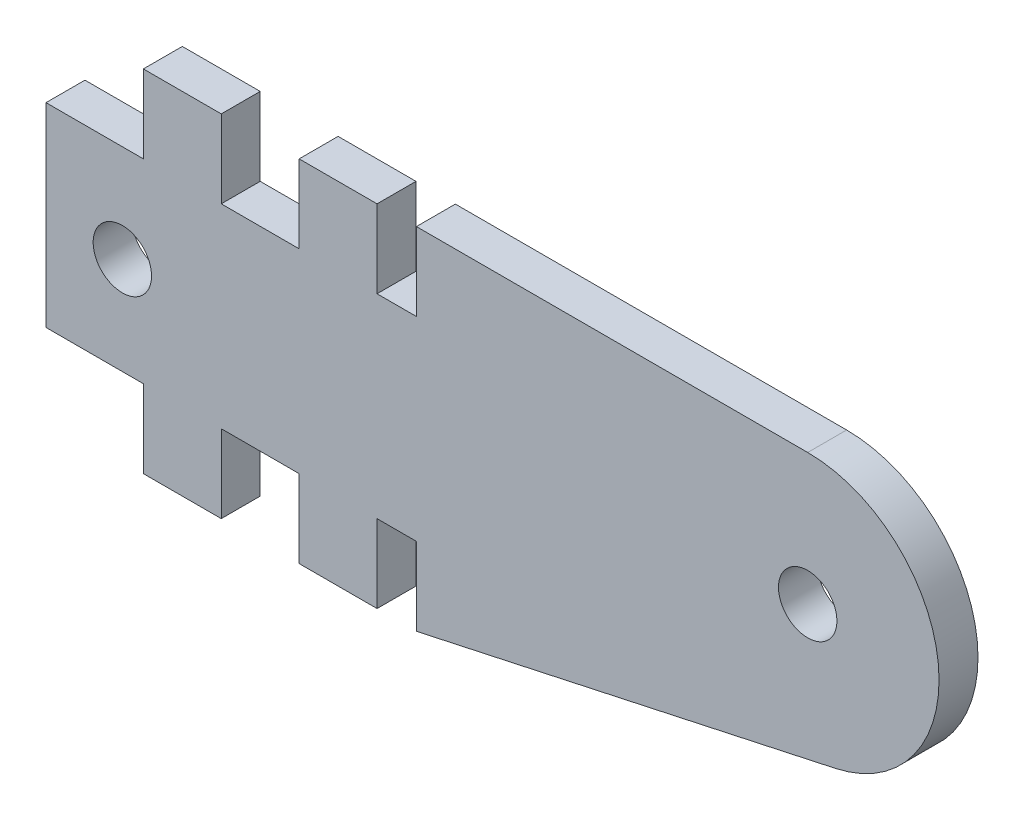
ISO-10303-21;
HEADER;
FILE_DESCRIPTION(('STEP AP214'),'2;1');
FILE_NAME('part.step','',(''),(''),'','','');
FILE_SCHEMA(('AUTOMOTIVE_DESIGN { 1 0 10303 214 1 1 1 1 }'));
ENDSEC;
DATA;
#1=APPLICATION_CONTEXT('core data for automotive mechanical design processes');
#2=APPLICATION_PROTOCOL_DEFINITION('international standard','automotive_design',2000,#1);
#3=PRODUCT_CONTEXT('',#1,'mechanical');
#4=PRODUCT('Part','Part','',(#3));
#5=PRODUCT_RELATED_PRODUCT_CATEGORY('part','',(#4));
#6=PRODUCT_DEFINITION_FORMATION('','',#4);
#7=PRODUCT_DEFINITION_CONTEXT('part definition',#1,'design');
#8=PRODUCT_DEFINITION('design','',#6,#7);
#9=PRODUCT_DEFINITION_SHAPE('','',#8);
#10=(LENGTH_UNIT() NAMED_UNIT(*) SI_UNIT(.MILLI.,.METRE.));
#11=(NAMED_UNIT(*) PLANE_ANGLE_UNIT() SI_UNIT($,.RADIAN.));
#12=(NAMED_UNIT(*) SI_UNIT($,.STERADIAN.) SOLID_ANGLE_UNIT());
#13=UNCERTAINTY_MEASURE_WITH_UNIT(LENGTH_MEASURE(1.E-05),#10,'distance_accuracy_value','');
#14=(GEOMETRIC_REPRESENTATION_CONTEXT(3) GLOBAL_UNCERTAINTY_ASSIGNED_CONTEXT((#13)) GLOBAL_UNIT_ASSIGNED_CONTEXT((#10,
#11,#12)) REPRESENTATION_CONTEXT('',''));
#15=CARTESIAN_POINT('',(0.,0.,0.));
#16=DIRECTION('',(0.,0.,1.));
#17=DIRECTION('',(1.,0.,0.));
#18=AXIS2_PLACEMENT_3D('',#15,#16,#17);
#19=CARTESIAN_POINT('',(39.11449585108,11.2546452739517,2.));
#20=DIRECTION('',(0.,0.,-1.));
#21=DIRECTION('',(-1.,0.,0.));
#22=AXIS2_PLACEMENT_3D('',#19,#20,#21);
#23=PLANE('',#22);
#24=CARTESIAN_POINT('',(39.11449585108,11.2546452739517,2.));
#25=DIRECTION('',(0.,0.,1.));
#26=DIRECTION('',(-1.,0.,0.));
#27=AXIS2_PLACEMENT_3D('',#24,#25,#26);
#28=CIRCLE('',#27,1.5);
#29=CARTESIAN_POINT('',(37.61449585108,11.2546452739517,2.));
#30=VERTEX_POINT('',#29);
#31=EDGE_CURVE('E230',#30,#30,#28,.T.);
#32=ORIENTED_EDGE('',*,*,#31,.F.);
#33=EDGE_LOOP('',(#32));
#34=FACE_BOUND('',#33,.T.);
#35=CARTESIAN_POINT('',(39.11449585108,11.2546452739517,2.));
#36=DIRECTION('',(0.,0.,1.));
#37=DIRECTION('',(-1.,0.,0.));
#38=AXIS2_PLACEMENT_3D('',#35,#36,#37);
#39=CIRCLE('',#38,6.74534308282998);
#40=CARTESIAN_POINT('',(40.5426460894979,4.66222233533582,2.));
#41=VERTEX_POINT('',#40);
#42=CARTESIAN_POINT('',(39.11449585108,17.9999883567817,2.));
#43=VERTEX_POINT('',#42);
#44=EDGE_CURVE('E273',#41,#43,#39,.T.);
#45=ORIENTED_EDGE('',*,*,#44,.T.);
#46=DIRECTION('',(-1.,0.,0.));
#47=VECTOR('',#46,1.);
#48=CARTESIAN_POINT('',(19.0215619335038,17.9999883567817,2.));
#49=LINE('',#48,#47);
#50=CARTESIAN_POINT('',(19.0215619335038,17.9999883567817,2.));
#51=VERTEX_POINT('',#50);
#52=EDGE_CURVE('E141',#43,#51,#49,.T.);
#53=ORIENTED_EDGE('',*,*,#52,.T.);
#54=DIRECTION('',(0.,-1.,0.));
#55=VECTOR('',#54,1.);
#56=CARTESIAN_POINT('',(19.0215619335038,13.9999883567817,2.));
#57=LINE('',#56,#55);
#58=CARTESIAN_POINT('',(19.0215619335038,13.9999883567817,2.));
#59=VERTEX_POINT('',#58);
#60=EDGE_CURVE('E336',#51,#59,#57,.T.);
#61=ORIENTED_EDGE('',*,*,#60,.T.);
#62=DIRECTION('',(-1.,0.,0.));
#63=VECTOR('',#62,1.);
#64=CARTESIAN_POINT('',(17.,13.9999883567817,2.));
#65=LINE('',#64,#63);
#66=CARTESIAN_POINT('',(17.,13.9999883567817,2.));
#67=VERTEX_POINT('',#66);
#68=EDGE_CURVE('E355',#59,#67,#65,.T.);
#69=ORIENTED_EDGE('',*,*,#68,.T.);
#70=DIRECTION('',(0.,1.,0.));
#71=VECTOR('',#70,1.);
#72=CARTESIAN_POINT('',(17.,17.9999883567817,2.));
#73=LINE('',#72,#71);
#74=CARTESIAN_POINT('',(17.,17.9999883567817,2.));
#75=VERTEX_POINT('',#74);
#76=EDGE_CURVE('E352',#67,#75,#73,.T.);
#77=ORIENTED_EDGE('',*,*,#76,.T.);
#78=DIRECTION('',(-1.,0.,0.));
#79=VECTOR('',#78,1.);
#80=CARTESIAN_POINT('',(13.,17.9999883567817,2.));
#81=LINE('',#80,#79);
#82=CARTESIAN_POINT('',(13.,17.9999883567817,2.));
#83=VERTEX_POINT('',#82);
#84=EDGE_CURVE('E354',#75,#83,#81,.T.);
#85=ORIENTED_EDGE('',*,*,#84,.T.);
#86=DIRECTION('',(0.,-1.,0.));
#87=VECTOR('',#86,1.);
#88=CARTESIAN_POINT('',(13.,13.9999883567817,2.));
#89=LINE('',#88,#87);
#90=CARTESIAN_POINT('',(13.,13.9999883567817,2.));
#91=VERTEX_POINT('',#90);
#92=EDGE_CURVE('E357',#83,#91,#89,.T.);
#93=ORIENTED_EDGE('',*,*,#92,.T.);
#94=DIRECTION('',(-1.,0.,0.));
#95=VECTOR('',#94,1.);
#96=CARTESIAN_POINT('',(9.,13.9999883567817,2.));
#97=LINE('',#96,#95);
#98=CARTESIAN_POINT('',(9.,13.9999883567817,2.));
#99=VERTEX_POINT('',#98);
#100=EDGE_CURVE('E363',#91,#99,#97,.T.);
#101=ORIENTED_EDGE('',*,*,#100,.T.);
#102=DIRECTION('',(0.,1.,0.));
#103=VECTOR('',#102,1.);
#104=CARTESIAN_POINT('',(9.,17.9999883567817,2.));
#105=LINE('',#104,#103);
#106=CARTESIAN_POINT('',(9.,17.9999883567817,2.));
#107=VERTEX_POINT('',#106);
#108=EDGE_CURVE('E365',#99,#107,#105,.T.);
#109=ORIENTED_EDGE('',*,*,#108,.T.);
#110=DIRECTION('',(-1.,0.,0.));
#111=VECTOR('',#110,1.);
#112=CARTESIAN_POINT('',(5.,17.9999883567817,2.));
#113=LINE('',#112,#111);
#114=CARTESIAN_POINT('',(5.,17.9999883567817,2.));
#115=VERTEX_POINT('',#114);
#116=EDGE_CURVE('E367',#107,#115,#113,.T.);
#117=ORIENTED_EDGE('',*,*,#116,.T.);
#118=DIRECTION('',(0.,-1.,0.));
#119=VECTOR('',#118,1.);
#120=CARTESIAN_POINT('',(5.,13.9999883567817,2.));
#121=LINE('',#120,#119);
#122=CARTESIAN_POINT('',(5.,13.9999883567817,2.));
#123=VERTEX_POINT('',#122);
#124=EDGE_CURVE('E369',#115,#123,#121,.T.);
#125=ORIENTED_EDGE('',*,*,#124,.T.);
#126=DIRECTION('',(-1.,0.,0.));
#127=VECTOR('',#126,1.);
#128=CARTESIAN_POINT('',(0.,13.9999883567817,2.));
#129=LINE('',#128,#127);
#130=CARTESIAN_POINT('',(0.,13.9999883567817,2.));
#131=VERTEX_POINT('',#130);
#132=EDGE_CURVE('E371',#123,#131,#129,.T.);
#133=ORIENTED_EDGE('',*,*,#132,.T.);
#134=DIRECTION('',(0.,-1.,0.));
#135=VECTOR('',#134,1.);
#136=CARTESIAN_POINT('',(0.,3.99999999999999,2.));
#137=LINE('',#136,#135);
#138=CARTESIAN_POINT('',(0.,3.99999999999999,2.));
#139=VERTEX_POINT('',#138);
#140=EDGE_CURVE('E373',#131,#139,#137,.T.);
#141=ORIENTED_EDGE('',*,*,#140,.T.);
#142=DIRECTION('',(1.,0.,0.));
#143=VECTOR('',#142,1.);
#144=CARTESIAN_POINT('',(5.,3.99999999999999,2.));
#145=LINE('',#144,#143);
#146=CARTESIAN_POINT('',(5.,3.99999999999999,2.));
#147=VERTEX_POINT('',#146);
#148=EDGE_CURVE('E375',#139,#147,#145,.T.);
#149=ORIENTED_EDGE('',*,*,#148,.T.);
#150=DIRECTION('',(0.,-1.,0.));
#151=VECTOR('',#150,1.);
#152=CARTESIAN_POINT('',(5.,3.99999999999999,2.));
#153=LINE('',#152,#151);
#154=CARTESIAN_POINT('',(5.,0.,2.));
#155=VERTEX_POINT('',#154);
#156=EDGE_CURVE('E377',#147,#155,#153,.T.);
#157=ORIENTED_EDGE('',*,*,#156,.T.);
#158=DIRECTION('',(1.,0.,0.));
#159=VECTOR('',#158,1.);
#160=CARTESIAN_POINT('',(5.,0.,2.));
#161=LINE('',#160,#159);
#162=CARTESIAN_POINT('',(8.99999999999999,0.,2.));
#163=VERTEX_POINT('',#162);
#164=EDGE_CURVE('E379',#155,#163,#161,.T.);
#165=ORIENTED_EDGE('',*,*,#164,.T.);
#166=DIRECTION('',(0.,1.,0.));
#167=VECTOR('',#166,1.);
#168=CARTESIAN_POINT('',(8.99999999999999,0.,2.));
#169=LINE('',#168,#167);
#170=CARTESIAN_POINT('',(8.99999999999999,4.,2.));
#171=VERTEX_POINT('',#170);
#172=EDGE_CURVE('E381',#163,#171,#169,.T.);
#173=ORIENTED_EDGE('',*,*,#172,.T.);
#174=DIRECTION('',(1.,0.,0.));
#175=VECTOR('',#174,1.);
#176=CARTESIAN_POINT('',(8.99999999999999,4.,2.));
#177=LINE('',#176,#175);
#178=CARTESIAN_POINT('',(13.,4.,2.));
#179=VERTEX_POINT('',#178);
#180=EDGE_CURVE('E383',#171,#179,#177,.T.);
#181=ORIENTED_EDGE('',*,*,#180,.T.);
#182=DIRECTION('',(0.,-1.,0.));
#183=VECTOR('',#182,1.);
#184=CARTESIAN_POINT('',(13.,4.,2.));
#185=LINE('',#184,#183);
#186=CARTESIAN_POINT('',(13.,0.,2.));
#187=VERTEX_POINT('',#186);
#188=EDGE_CURVE('E385',#179,#187,#185,.T.);
#189=ORIENTED_EDGE('',*,*,#188,.T.);
#190=DIRECTION('',(1.,0.,0.));
#191=VECTOR('',#190,1.);
#192=CARTESIAN_POINT('',(13.,0.,2.));
#193=LINE('',#192,#191);
#194=CARTESIAN_POINT('',(17.,0.,2.));
#195=VERTEX_POINT('',#194);
#196=EDGE_CURVE('E387',#187,#195,#193,.T.);
#197=ORIENTED_EDGE('',*,*,#196,.T.);
#198=DIRECTION('',(0.,1.,0.));
#199=VECTOR('',#198,1.);
#200=CARTESIAN_POINT('',(17.,0.,2.));
#201=LINE('',#200,#199);
#202=CARTESIAN_POINT('',(17.,3.99999999999999,2.));
#203=VERTEX_POINT('',#202);
#204=EDGE_CURVE('E208',#195,#203,#201,.T.);
#205=ORIENTED_EDGE('',*,*,#204,.T.);
#206=DIRECTION('',(1.,0.,0.));
#207=VECTOR('',#206,1.);
#208=CARTESIAN_POINT('',(17.,3.99999999999999,2.));
#209=LINE('',#208,#207);
#210=CARTESIAN_POINT('',(19.0215619335038,3.99999999999999,2.));
#211=VERTEX_POINT('',#210);
#212=EDGE_CURVE('E202',#203,#211,#209,.T.);
#213=ORIENTED_EDGE('',*,*,#212,.T.);
#214=DIRECTION('',(0.,-1.,0.));
#215=VECTOR('',#214,1.);
#216=CARTESIAN_POINT('',(19.0215619335038,3.99999999999999,2.));
#217=LINE('',#216,#215);
#218=CARTESIAN_POINT('',(19.0215619335039,0.,2.));
#219=VERTEX_POINT('',#218);
#220=EDGE_CURVE('E206',#211,#219,#217,.T.);
#221=ORIENTED_EDGE('',*,*,#220,.T.);
#222=DIRECTION('',(0.977329523148595,0.21172388429778,0.));
#223=VECTOR('',#222,1.);
#224=CARTESIAN_POINT('',(19.0215619335039,0.,2.));
#225=LINE('',#224,#223);
#226=EDGE_CURVE('E50',#219,#41,#225,.T.);
#227=ORIENTED_EDGE('',*,*,#226,.T.);
#228=EDGE_LOOP('',(#45,#53,#61,#69,#77,#85,#93,#101,#109,#117,#125,#133,#141,#149,#157,#165,
#173,#181,#189,#197,#205,#213,#221,#227));
#229=FACE_BOUND('',#228,.T.);
#230=CARTESIAN_POINT('',(3.92049009293527,8.99998835678172,2.));
#231=DIRECTION('',(0.,0.,1.));
#232=DIRECTION('',(-1.,0.,0.));
#233=AXIS2_PLACEMENT_3D('',#230,#231,#232);
#234=CIRCLE('',#233,1.5);
#235=CARTESIAN_POINT('',(2.42049009293526,8.99998835678172,2.));
#236=VERTEX_POINT('',#235);
#237=EDGE_CURVE('E430',#236,#236,#234,.T.);
#238=ORIENTED_EDGE('',*,*,#237,.F.);
#239=EDGE_LOOP('',(#238));
#240=FACE_BOUND('',#239,.T.);
#241=ADVANCED_FACE('F33',(#34,#229,#240),#23,.F.);
#242=CARTESIAN_POINT('',(39.11449585108,11.2546452739517,0.));
#243=DIRECTION('',(0.,0.,-1.));
#244=DIRECTION('',(-1.,0.,0.));
#245=AXIS2_PLACEMENT_3D('',#242,#243,#244);
#246=PLANE('',#245);
#247=CARTESIAN_POINT('',(39.11449585108,11.2546452739517,0.));
#248=DIRECTION('',(0.,0.,1.));
#249=DIRECTION('',(-1.,0.,0.));
#250=AXIS2_PLACEMENT_3D('',#247,#248,#249);
#251=CIRCLE('',#250,1.5);
#252=CARTESIAN_POINT('',(37.61449585108,11.2546452739517,0.));
#253=VERTEX_POINT('',#252);
#254=EDGE_CURVE('E435',#253,#253,#251,.T.);
#255=ORIENTED_EDGE('',*,*,#254,.T.);
#256=EDGE_LOOP('',(#255));
#257=FACE_BOUND('',#256,.T.);
#258=CARTESIAN_POINT('',(39.11449585108,11.2546452739517,0.));
#259=DIRECTION('',(0.,0.,1.));
#260=DIRECTION('',(-1.,0.,0.));
#261=AXIS2_PLACEMENT_3D('',#258,#259,#260);
#262=CIRCLE('',#261,6.74534308282998);
#263=CARTESIAN_POINT('',(40.5426460894979,4.66222233533582,0.));
#264=VERTEX_POINT('',#263);
#265=CARTESIAN_POINT('',(39.11449585108,17.9999883567817,0.));
#266=VERTEX_POINT('',#265);
#267=EDGE_CURVE('E226',#264,#266,#262,.T.);
#268=ORIENTED_EDGE('',*,*,#267,.F.);
#269=DIRECTION('',(0.977329523148595,0.21172388429778,0.));
#270=VECTOR('',#269,1.);
#271=CARTESIAN_POINT('',(19.0215619335039,0.,0.));
#272=LINE('',#271,#270);
#273=CARTESIAN_POINT('',(19.0215619335039,0.,0.));
#274=VERTEX_POINT('',#273);
#275=EDGE_CURVE('E133',#274,#264,#272,.T.);
#276=ORIENTED_EDGE('',*,*,#275,.F.);
#277=DIRECTION('',(0.,-1.,0.));
#278=VECTOR('',#277,1.);
#279=CARTESIAN_POINT('',(19.0215619335038,3.99999999999999,0.));
#280=LINE('',#279,#278);
#281=CARTESIAN_POINT('',(19.0215619335038,3.99999999999999,0.));
#282=VERTEX_POINT('',#281);
#283=EDGE_CURVE('E127',#282,#274,#280,.T.);
#284=ORIENTED_EDGE('',*,*,#283,.F.);
#285=DIRECTION('',(1.,0.,0.));
#286=VECTOR('',#285,1.);
#287=CARTESIAN_POINT('',(17.,3.99999999999999,0.));
#288=LINE('',#287,#286);
#289=CARTESIAN_POINT('',(17.,3.99999999999999,0.));
#290=VERTEX_POINT('',#289);
#291=EDGE_CURVE('E216',#290,#282,#288,.T.);
#292=ORIENTED_EDGE('',*,*,#291,.F.);
#293=DIRECTION('',(0.,1.,0.));
#294=VECTOR('',#293,1.);
#295=CARTESIAN_POINT('',(17.,0.,0.));
#296=LINE('',#295,#294);
#297=CARTESIAN_POINT('',(17.,0.,0.));
#298=VERTEX_POINT('',#297);
#299=EDGE_CURVE('E268',#298,#290,#296,.T.);
#300=ORIENTED_EDGE('',*,*,#299,.F.);
#301=DIRECTION('',(1.,0.,0.));
#302=VECTOR('',#301,1.);
#303=CARTESIAN_POINT('',(13.,0.,0.));
#304=LINE('',#303,#302);
#305=CARTESIAN_POINT('',(13.,0.,0.));
#306=VERTEX_POINT('',#305);
#307=EDGE_CURVE('E266',#306,#298,#304,.T.);
#308=ORIENTED_EDGE('',*,*,#307,.F.);
#309=DIRECTION('',(0.,-1.,0.));
#310=VECTOR('',#309,1.);
#311=CARTESIAN_POINT('',(13.,4.,0.));
#312=LINE('',#311,#310);
#313=CARTESIAN_POINT('',(13.,4.,0.));
#314=VERTEX_POINT('',#313);
#315=EDGE_CURVE('E264',#314,#306,#312,.T.);
#316=ORIENTED_EDGE('',*,*,#315,.F.);
#317=DIRECTION('',(1.,0.,0.));
#318=VECTOR('',#317,1.);
#319=CARTESIAN_POINT('',(8.99999999999999,4.,0.));
#320=LINE('',#319,#318);
#321=CARTESIAN_POINT('',(8.99999999999999,4.,0.));
#322=VERTEX_POINT('',#321);
#323=EDGE_CURVE('E262',#322,#314,#320,.T.);
#324=ORIENTED_EDGE('',*,*,#323,.F.);
#325=DIRECTION('',(0.,1.,0.));
#326=VECTOR('',#325,1.);
#327=CARTESIAN_POINT('',(8.99999999999999,0.,0.));
#328=LINE('',#327,#326);
#329=CARTESIAN_POINT('',(8.99999999999999,0.,0.));
#330=VERTEX_POINT('',#329);
#331=EDGE_CURVE('E260',#330,#322,#328,.T.);
#332=ORIENTED_EDGE('',*,*,#331,.F.);
#333=DIRECTION('',(1.,0.,0.));
#334=VECTOR('',#333,1.);
#335=CARTESIAN_POINT('',(5.,0.,0.));
#336=LINE('',#335,#334);
#337=CARTESIAN_POINT('',(5.,0.,0.));
#338=VERTEX_POINT('',#337);
#339=EDGE_CURVE('E258',#338,#330,#336,.T.);
#340=ORIENTED_EDGE('',*,*,#339,.F.);
#341=DIRECTION('',(0.,-1.,0.));
#342=VECTOR('',#341,1.);
#343=CARTESIAN_POINT('',(5.,3.99999999999999,0.));
#344=LINE('',#343,#342);
#345=CARTESIAN_POINT('',(5.,3.99999999999999,0.));
#346=VERTEX_POINT('',#345);
#347=EDGE_CURVE('E256',#346,#338,#344,.T.);
#348=ORIENTED_EDGE('',*,*,#347,.F.);
#349=DIRECTION('',(1.,0.,0.));
#350=VECTOR('',#349,1.);
#351=CARTESIAN_POINT('',(5.,3.99999999999999,0.));
#352=LINE('',#351,#350);
#353=CARTESIAN_POINT('',(0.,3.99999999999999,0.));
#354=VERTEX_POINT('',#353);
#355=EDGE_CURVE('E254',#354,#346,#352,.T.);
#356=ORIENTED_EDGE('',*,*,#355,.F.);
#357=DIRECTION('',(0.,-1.,0.));
#358=VECTOR('',#357,1.);
#359=CARTESIAN_POINT('',(0.,3.99999999999999,0.));
#360=LINE('',#359,#358);
#361=CARTESIAN_POINT('',(0.,13.9999883567817,0.));
#362=VERTEX_POINT('',#361);
#363=EDGE_CURVE('E252',#362,#354,#360,.T.);
#364=ORIENTED_EDGE('',*,*,#363,.F.);
#365=DIRECTION('',(-1.,0.,0.));
#366=VECTOR('',#365,1.);
#367=CARTESIAN_POINT('',(0.,13.9999883567817,0.));
#368=LINE('',#367,#366);
#369=CARTESIAN_POINT('',(5.,13.9999883567817,0.));
#370=VERTEX_POINT('',#369);
#371=EDGE_CURVE('E250',#370,#362,#368,.T.);
#372=ORIENTED_EDGE('',*,*,#371,.F.);
#373=DIRECTION('',(0.,-1.,0.));
#374=VECTOR('',#373,1.);
#375=CARTESIAN_POINT('',(5.,13.9999883567817,0.));
#376=LINE('',#375,#374);
#377=CARTESIAN_POINT('',(5.,17.9999883567817,0.));
#378=VERTEX_POINT('',#377);
#379=EDGE_CURVE('E248',#378,#370,#376,.T.);
#380=ORIENTED_EDGE('',*,*,#379,.F.);
#381=DIRECTION('',(-1.,0.,0.));
#382=VECTOR('',#381,1.);
#383=CARTESIAN_POINT('',(5.,17.9999883567817,0.));
#384=LINE('',#383,#382);
#385=CARTESIAN_POINT('',(9.,17.9999883567817,0.));
#386=VERTEX_POINT('',#385);
#387=EDGE_CURVE('E246',#386,#378,#384,.T.);
#388=ORIENTED_EDGE('',*,*,#387,.F.);
#389=DIRECTION('',(0.,1.,0.));
#390=VECTOR('',#389,1.);
#391=CARTESIAN_POINT('',(9.,17.9999883567817,0.));
#392=LINE('',#391,#390);
#393=CARTESIAN_POINT('',(9.,13.9999883567817,0.));
#394=VERTEX_POINT('',#393);
#395=EDGE_CURVE('E244',#394,#386,#392,.T.);
#396=ORIENTED_EDGE('',*,*,#395,.F.);
#397=DIRECTION('',(-1.,0.,0.));
#398=VECTOR('',#397,1.);
#399=CARTESIAN_POINT('',(9.,13.9999883567817,0.));
#400=LINE('',#399,#398);
#401=CARTESIAN_POINT('',(13.,13.9999883567817,0.));
#402=VERTEX_POINT('',#401);
#403=EDGE_CURVE('E242',#402,#394,#400,.T.);
#404=ORIENTED_EDGE('',*,*,#403,.F.);
#405=DIRECTION('',(0.,-1.,0.));
#406=VECTOR('',#405,1.);
#407=CARTESIAN_POINT('',(13.,13.9999883567817,0.));
#408=LINE('',#407,#406);
#409=CARTESIAN_POINT('',(13.,17.9999883567817,0.));
#410=VERTEX_POINT('',#409);
#411=EDGE_CURVE('E240',#410,#402,#408,.T.);
#412=ORIENTED_EDGE('',*,*,#411,.F.);
#413=DIRECTION('',(-1.,0.,0.));
#414=VECTOR('',#413,1.);
#415=CARTESIAN_POINT('',(13.,17.9999883567817,0.));
#416=LINE('',#415,#414);
#417=CARTESIAN_POINT('',(17.,17.9999883567817,0.));
#418=VERTEX_POINT('',#417);
#419=EDGE_CURVE('E238',#418,#410,#416,.T.);
#420=ORIENTED_EDGE('',*,*,#419,.F.);
#421=DIRECTION('',(0.,1.,0.));
#422=VECTOR('',#421,1.);
#423=CARTESIAN_POINT('',(17.,17.9999883567817,0.));
#424=LINE('',#423,#422);
#425=CARTESIAN_POINT('',(17.,13.9999883567817,0.));
#426=VERTEX_POINT('',#425);
#427=EDGE_CURVE('E236',#426,#418,#424,.T.);
#428=ORIENTED_EDGE('',*,*,#427,.F.);
#429=DIRECTION('',(-1.,0.,0.));
#430=VECTOR('',#429,1.);
#431=CARTESIAN_POINT('',(17.,13.9999883567817,0.));
#432=LINE('',#431,#430);
#433=CARTESIAN_POINT('',(19.0215619335038,13.9999883567817,0.));
#434=VERTEX_POINT('',#433);
#435=EDGE_CURVE('E234',#434,#426,#432,.T.);
#436=ORIENTED_EDGE('',*,*,#435,.F.);
#437=DIRECTION('',(0.,-1.,0.));
#438=VECTOR('',#437,1.);
#439=CARTESIAN_POINT('',(19.0215619335038,13.9999883567817,0.));
#440=LINE('',#439,#438);
#441=CARTESIAN_POINT('',(19.0215619335038,17.9999883567817,0.));
#442=VERTEX_POINT('',#441);
#443=EDGE_CURVE('E232',#442,#434,#440,.T.);
#444=ORIENTED_EDGE('',*,*,#443,.F.);
#445=DIRECTION('',(-1.,0.,0.));
#446=VECTOR('',#445,1.);
#447=CARTESIAN_POINT('',(19.0215619335038,17.9999883567817,0.));
#448=LINE('',#447,#446);
#449=EDGE_CURVE('E229',#266,#442,#448,.T.);
#450=ORIENTED_EDGE('',*,*,#449,.F.);
#451=EDGE_LOOP('',(#268,#276,#284,#292,#300,#308,#316,#324,#332,#340,#348,#356,#364,#372,#380,
#388,#396,#404,#412,#420,#428,#436,#444,#450));
#452=FACE_BOUND('',#451,.T.);
#453=CARTESIAN_POINT('',(3.92049009293527,8.99998835678172,0.));
#454=DIRECTION('',(0.,0.,1.));
#455=DIRECTION('',(-1.,0.,0.));
#456=AXIS2_PLACEMENT_3D('',#453,#454,#455);
#457=CIRCLE('',#456,1.5);
#458=CARTESIAN_POINT('',(2.42049009293526,8.99998835678172,0.));
#459=VERTEX_POINT('',#458);
#460=EDGE_CURVE('E433',#459,#459,#457,.T.);
#461=ORIENTED_EDGE('',*,*,#460,.T.);
#462=EDGE_LOOP('',(#461));
#463=FACE_BOUND('',#462,.T.);
#464=ADVANCED_FACE('F340',(#257,#452,#463),#246,.T.);
#465=CARTESIAN_POINT('',(39.11449585108,11.2546452739517,2.));
#466=DIRECTION('',(0.,0.,-1.));
#467=DIRECTION('',(-1.,0.,0.));
#468=AXIS2_PLACEMENT_3D('',#465,#466,#467);
#469=CYLINDRICAL_SURFACE('',#468,6.74534308282998);
#470=ORIENTED_EDGE('',*,*,#267,.T.);
#471=DIRECTION('',(0.,0.,-1.));
#472=VECTOR('',#471,1.);
#473=CARTESIAN_POINT('',(39.11449585108,17.9999883567817,2.));
#474=LINE('',#473,#472);
#475=EDGE_CURVE('E11',#43,#266,#474,.T.);
#476=ORIENTED_EDGE('',*,*,#475,.F.);
#477=ORIENTED_EDGE('',*,*,#44,.F.);
#478=DIRECTION('',(0.,0.,-1.));
#479=VECTOR('',#478,1.);
#480=CARTESIAN_POINT('',(40.5426460894979,4.66222233533582,2.));
#481=LINE('',#480,#479);
#482=EDGE_CURVE('E222',#41,#264,#481,.T.);
#483=ORIENTED_EDGE('',*,*,#482,.T.);
#484=EDGE_LOOP('',(#470,#476,#477,#483));
#485=FACE_BOUND('',#484,.T.);
#486=ADVANCED_FACE('F35',(#485),#469,.T.);
#487=CARTESIAN_POINT('',(19.0215619335038,17.9999883567817,2.));
#488=DIRECTION('',(0.,-1.,0.));
#489=DIRECTION('',(0.,0.,-1.));
#490=AXIS2_PLACEMENT_3D('',#487,#488,#489);
#491=PLANE('',#490);
#492=ORIENTED_EDGE('',*,*,#449,.T.);
#493=DIRECTION('',(0.,0.,-1.));
#494=VECTOR('',#493,1.);
#495=CARTESIAN_POINT('',(19.0215619335038,17.9999883567817,2.));
#496=LINE('',#495,#494);
#497=EDGE_CURVE('E42',#51,#442,#496,.T.);
#498=ORIENTED_EDGE('',*,*,#497,.F.);
#499=ORIENTED_EDGE('',*,*,#52,.F.);
#500=ORIENTED_EDGE('',*,*,#475,.T.);
#501=EDGE_LOOP('',(#492,#498,#499,#500));
#502=FACE_BOUND('',#501,.T.);
#503=ADVANCED_FACE('F648',(#502),#491,.F.);
#504=CARTESIAN_POINT('',(19.0215619335038,13.9999883567817,2.));
#505=DIRECTION('',(1.,0.,0.));
#506=DIRECTION('',(0.,0.,-1.));
#507=AXIS2_PLACEMENT_3D('',#504,#505,#506);
#508=PLANE('',#507);
#509=ORIENTED_EDGE('',*,*,#443,.T.);
#510=DIRECTION('',(0.,0.,-1.));
#511=VECTOR('',#510,1.);
#512=CARTESIAN_POINT('',(19.0215619335038,13.9999883567817,2.));
#513=LINE('',#512,#511);
#514=EDGE_CURVE('E328',#59,#434,#513,.T.);
#515=ORIENTED_EDGE('',*,*,#514,.F.);
#516=ORIENTED_EDGE('',*,*,#60,.F.);
#517=ORIENTED_EDGE('',*,*,#497,.T.);
#518=EDGE_LOOP('',(#509,#515,#516,#517));
#519=FACE_BOUND('',#518,.T.);
#520=ADVANCED_FACE('F334',(#519),#508,.F.);
#521=CARTESIAN_POINT('',(17.,13.9999883567817,2.));
#522=DIRECTION('',(0.,-1.,0.));
#523=DIRECTION('',(0.,0.,-1.));
#524=AXIS2_PLACEMENT_3D('',#521,#522,#523);
#525=PLANE('',#524);
#526=ORIENTED_EDGE('',*,*,#435,.T.);
#527=DIRECTION('',(0.,0.,-1.));
#528=VECTOR('',#527,1.);
#529=CARTESIAN_POINT('',(17.,13.9999883567817,2.));
#530=LINE('',#529,#528);
#531=EDGE_CURVE('E325',#67,#426,#530,.T.);
#532=ORIENTED_EDGE('',*,*,#531,.F.);
#533=ORIENTED_EDGE('',*,*,#68,.F.);
#534=ORIENTED_EDGE('',*,*,#514,.T.);
#535=EDGE_LOOP('',(#526,#532,#533,#534));
#536=FACE_BOUND('',#535,.T.);
#537=ADVANCED_FACE('F346',(#536),#525,.F.);
#538=CARTESIAN_POINT('',(17.,17.9999883567817,2.));
#539=DIRECTION('',(-1.,0.,0.));
#540=DIRECTION('',(0.,0.,1.));
#541=AXIS2_PLACEMENT_3D('',#538,#539,#540);
#542=PLANE('',#541);
#543=ORIENTED_EDGE('',*,*,#427,.T.);
#544=DIRECTION('',(0.,0.,-1.));
#545=VECTOR('',#544,1.);
#546=CARTESIAN_POINT('',(17.,17.9999883567817,2.));
#547=LINE('',#546,#545);
#548=EDGE_CURVE('E322',#75,#418,#547,.T.);
#549=ORIENTED_EDGE('',*,*,#548,.F.);
#550=ORIENTED_EDGE('',*,*,#76,.F.);
#551=ORIENTED_EDGE('',*,*,#531,.T.);
#552=EDGE_LOOP('',(#543,#549,#550,#551));
#553=FACE_BOUND('',#552,.T.);
#554=ADVANCED_FACE('F350',(#553),#542,.F.);
#555=CARTESIAN_POINT('',(13.,17.9999883567817,2.));
#556=DIRECTION('',(0.,-1.,0.));
#557=DIRECTION('',(0.,0.,-1.));
#558=AXIS2_PLACEMENT_3D('',#555,#556,#557);
#559=PLANE('',#558);
#560=ORIENTED_EDGE('',*,*,#419,.T.);
#561=DIRECTION('',(0.,0.,-1.));
#562=VECTOR('',#561,1.);
#563=CARTESIAN_POINT('',(13.,17.9999883567817,2.));
#564=LINE('',#563,#562);
#565=EDGE_CURVE('E319',#83,#410,#564,.T.);
#566=ORIENTED_EDGE('',*,*,#565,.F.);
#567=ORIENTED_EDGE('',*,*,#84,.F.);
#568=ORIENTED_EDGE('',*,*,#548,.T.);
#569=EDGE_LOOP('',(#560,#566,#567,#568));
#570=FACE_BOUND('',#569,.T.);
#571=ADVANCED_FACE('F613',(#570),#559,.F.);
#572=CARTESIAN_POINT('',(13.,13.9999883567817,2.));
#573=DIRECTION('',(1.,0.,0.));
#574=DIRECTION('',(0.,1.,0.));
#575=AXIS2_PLACEMENT_3D('',#572,#573,#574);
#576=PLANE('',#575);
#577=ORIENTED_EDGE('',*,*,#411,.T.);
#578=DIRECTION('',(0.,0.,-1.));
#579=VECTOR('',#578,1.);
#580=CARTESIAN_POINT('',(13.,13.9999883567817,2.));
#581=LINE('',#580,#579);
#582=EDGE_CURVE('E316',#91,#402,#581,.T.);
#583=ORIENTED_EDGE('',*,*,#582,.F.);
#584=ORIENTED_EDGE('',*,*,#92,.F.);
#585=ORIENTED_EDGE('',*,*,#565,.T.);
#586=EDGE_LOOP('',(#577,#583,#584,#585));
#587=FACE_BOUND('',#586,.T.);
#588=ADVANCED_FACE('F603',(#587),#576,.F.);
#589=CARTESIAN_POINT('',(9.,13.9999883567817,2.));
#590=DIRECTION('',(0.,-1.,0.));
#591=DIRECTION('',(0.,0.,-1.));
#592=AXIS2_PLACEMENT_3D('',#589,#590,#591);
#593=PLANE('',#592);
#594=ORIENTED_EDGE('',*,*,#403,.T.);
#595=DIRECTION('',(0.,0.,-1.));
#596=VECTOR('',#595,1.);
#597=CARTESIAN_POINT('',(9.,13.9999883567817,2.));
#598=LINE('',#597,#596);
#599=EDGE_CURVE('E313',#99,#394,#598,.T.);
#600=ORIENTED_EDGE('',*,*,#599,.F.);
#601=ORIENTED_EDGE('',*,*,#100,.F.);
#602=ORIENTED_EDGE('',*,*,#582,.T.);
#603=EDGE_LOOP('',(#594,#600,#601,#602));
#604=FACE_BOUND('',#603,.T.);
#605=ADVANCED_FACE('F593',(#604),#593,.F.);
#606=CARTESIAN_POINT('',(9.,17.9999883567817,2.));
#607=DIRECTION('',(-1.,0.,0.));
#608=DIRECTION('',(0.,0.,1.));
#609=AXIS2_PLACEMENT_3D('',#606,#607,#608);
#610=PLANE('',#609);
#611=ORIENTED_EDGE('',*,*,#395,.T.);
#612=DIRECTION('',(0.,0.,-1.));
#613=VECTOR('',#612,1.);
#614=CARTESIAN_POINT('',(9.,17.9999883567817,2.));
#615=LINE('',#614,#613);
#616=EDGE_CURVE('E310',#107,#386,#615,.T.);
#617=ORIENTED_EDGE('',*,*,#616,.F.);
#618=ORIENTED_EDGE('',*,*,#108,.F.);
#619=ORIENTED_EDGE('',*,*,#599,.T.);
#620=EDGE_LOOP('',(#611,#617,#618,#619));
#621=FACE_BOUND('',#620,.T.);
#622=ADVANCED_FACE('F583',(#621),#610,.F.);
#623=CARTESIAN_POINT('',(5.,17.9999883567817,2.));
#624=DIRECTION('',(0.,-1.,0.));
#625=DIRECTION('',(0.,0.,-1.));
#626=AXIS2_PLACEMENT_3D('',#623,#624,#625);
#627=PLANE('',#626);
#628=ORIENTED_EDGE('',*,*,#387,.T.);
#629=DIRECTION('',(0.,0.,-1.));
#630=VECTOR('',#629,1.);
#631=CARTESIAN_POINT('',(5.,17.9999883567817,2.));
#632=LINE('',#631,#630);
#633=EDGE_CURVE('E307',#115,#378,#632,.T.);
#634=ORIENTED_EDGE('',*,*,#633,.F.);
#635=ORIENTED_EDGE('',*,*,#116,.F.);
#636=ORIENTED_EDGE('',*,*,#616,.T.);
#637=EDGE_LOOP('',(#628,#634,#635,#636));
#638=FACE_BOUND('',#637,.T.);
#639=ADVANCED_FACE('F573',(#638),#627,.F.);
#640=CARTESIAN_POINT('',(5.,13.9999883567817,2.));
#641=DIRECTION('',(1.,0.,0.));
#642=DIRECTION('',(0.,0.,-1.));
#643=AXIS2_PLACEMENT_3D('',#640,#641,#642);
#644=PLANE('',#643);
#645=ORIENTED_EDGE('',*,*,#379,.T.);
#646=DIRECTION('',(0.,0.,-1.));
#647=VECTOR('',#646,1.);
#648=CARTESIAN_POINT('',(5.,13.9999883567817,2.));
#649=LINE('',#648,#647);
#650=EDGE_CURVE('E304',#123,#370,#649,.T.);
#651=ORIENTED_EDGE('',*,*,#650,.F.);
#652=ORIENTED_EDGE('',*,*,#124,.F.);
#653=ORIENTED_EDGE('',*,*,#633,.T.);
#654=EDGE_LOOP('',(#645,#651,#652,#653));
#655=FACE_BOUND('',#654,.T.);
#656=ADVANCED_FACE('F563',(#655),#644,.F.);
#657=CARTESIAN_POINT('',(0.,13.9999883567817,2.));
#658=DIRECTION('',(0.,-1.,0.));
#659=DIRECTION('',(0.,0.,-1.));
#660=AXIS2_PLACEMENT_3D('',#657,#658,#659);
#661=PLANE('',#660);
#662=ORIENTED_EDGE('',*,*,#371,.T.);
#663=DIRECTION('',(0.,0.,-1.));
#664=VECTOR('',#663,1.);
#665=CARTESIAN_POINT('',(0.,13.9999883567817,2.));
#666=LINE('',#665,#664);
#667=EDGE_CURVE('E301',#131,#362,#666,.T.);
#668=ORIENTED_EDGE('',*,*,#667,.F.);
#669=ORIENTED_EDGE('',*,*,#132,.F.);
#670=ORIENTED_EDGE('',*,*,#650,.T.);
#671=EDGE_LOOP('',(#662,#668,#669,#670));
#672=FACE_BOUND('',#671,.T.);
#673=ADVANCED_FACE('F553',(#672),#661,.F.);
#674=CARTESIAN_POINT('',(0.,3.99999999999999,2.));
#675=DIRECTION('',(1.,0.,0.));
#676=DIRECTION('',(0.,0.,-1.));
#677=AXIS2_PLACEMENT_3D('',#674,#675,#676);
#678=PLANE('',#677);
#679=ORIENTED_EDGE('',*,*,#363,.T.);
#680=DIRECTION('',(0.,0.,-1.));
#681=VECTOR('',#680,1.);
#682=CARTESIAN_POINT('',(0.,3.99999999999999,2.));
#683=LINE('',#682,#681);
#684=EDGE_CURVE('E298',#139,#354,#683,.T.);
#685=ORIENTED_EDGE('',*,*,#684,.F.);
#686=ORIENTED_EDGE('',*,*,#140,.F.);
#687=ORIENTED_EDGE('',*,*,#667,.T.);
#688=EDGE_LOOP('',(#679,#685,#686,#687));
#689=FACE_BOUND('',#688,.T.);
#690=ADVANCED_FACE('F543',(#689),#678,.F.);
#691=CARTESIAN_POINT('',(5.,3.99999999999999,2.));
#692=DIRECTION('',(0.,1.,0.));
#693=DIRECTION('',(0.,0.,1.));
#694=AXIS2_PLACEMENT_3D('',#691,#692,#693);
#695=PLANE('',#694);
#696=ORIENTED_EDGE('',*,*,#355,.T.);
#697=DIRECTION('',(0.,0.,-1.));
#698=VECTOR('',#697,1.);
#699=CARTESIAN_POINT('',(5.,3.99999999999999,2.));
#700=LINE('',#699,#698);
#701=EDGE_CURVE('E295',#147,#346,#700,.T.);
#702=ORIENTED_EDGE('',*,*,#701,.F.);
#703=ORIENTED_EDGE('',*,*,#148,.F.);
#704=ORIENTED_EDGE('',*,*,#684,.T.);
#705=EDGE_LOOP('',(#696,#702,#703,#704));
#706=FACE_BOUND('',#705,.T.);
#707=ADVANCED_FACE('F533',(#706),#695,.F.);
#708=CARTESIAN_POINT('',(5.,3.99999999999999,2.));
#709=DIRECTION('',(1.,0.,0.));
#710=DIRECTION('',(0.,0.,-1.));
#711=AXIS2_PLACEMENT_3D('',#708,#709,#710);
#712=PLANE('',#711);
#713=ORIENTED_EDGE('',*,*,#347,.T.);
#714=DIRECTION('',(0.,0.,-1.));
#715=VECTOR('',#714,1.);
#716=CARTESIAN_POINT('',(5.,0.,2.));
#717=LINE('',#716,#715);
#718=EDGE_CURVE('E292',#155,#338,#717,.T.);
#719=ORIENTED_EDGE('',*,*,#718,.F.);
#720=ORIENTED_EDGE('',*,*,#156,.F.);
#721=ORIENTED_EDGE('',*,*,#701,.T.);
#722=EDGE_LOOP('',(#713,#719,#720,#721));
#723=FACE_BOUND('',#722,.T.);
#724=ADVANCED_FACE('F523',(#723),#712,.F.);
#725=CARTESIAN_POINT('',(5.,0.,2.));
#726=DIRECTION('',(0.,1.,0.));
#727=DIRECTION('',(0.,0.,1.));
#728=AXIS2_PLACEMENT_3D('',#725,#726,#727);
#729=PLANE('',#728);
#730=ORIENTED_EDGE('',*,*,#339,.T.);
#731=DIRECTION('',(0.,0.,-1.));
#732=VECTOR('',#731,1.);
#733=CARTESIAN_POINT('',(8.99999999999999,0.,2.));
#734=LINE('',#733,#732);
#735=EDGE_CURVE('E289',#163,#330,#734,.T.);
#736=ORIENTED_EDGE('',*,*,#735,.F.);
#737=ORIENTED_EDGE('',*,*,#164,.F.);
#738=ORIENTED_EDGE('',*,*,#718,.T.);
#739=EDGE_LOOP('',(#730,#736,#737,#738));
#740=FACE_BOUND('',#739,.T.);
#741=ADVANCED_FACE('F513',(#740),#729,.F.);
#742=CARTESIAN_POINT('',(8.99999999999999,0.,2.));
#743=DIRECTION('',(-1.,0.,0.));
#744=DIRECTION('',(0.,0.,1.));
#745=AXIS2_PLACEMENT_3D('',#742,#743,#744);
#746=PLANE('',#745);
#747=ORIENTED_EDGE('',*,*,#331,.T.);
#748=DIRECTION('',(0.,0.,-1.));
#749=VECTOR('',#748,1.);
#750=CARTESIAN_POINT('',(8.99999999999999,4.,2.));
#751=LINE('',#750,#749);
#752=EDGE_CURVE('E286',#171,#322,#751,.T.);
#753=ORIENTED_EDGE('',*,*,#752,.F.);
#754=ORIENTED_EDGE('',*,*,#172,.F.);
#755=ORIENTED_EDGE('',*,*,#735,.T.);
#756=EDGE_LOOP('',(#747,#753,#754,#755));
#757=FACE_BOUND('',#756,.T.);
#758=ADVANCED_FACE('F503',(#757),#746,.F.);
#759=CARTESIAN_POINT('',(8.99999999999999,4.,2.));
#760=DIRECTION('',(0.,1.,0.));
#761=DIRECTION('',(0.,0.,1.));
#762=AXIS2_PLACEMENT_3D('',#759,#760,#761);
#763=PLANE('',#762);
#764=ORIENTED_EDGE('',*,*,#323,.T.);
#765=DIRECTION('',(0.,0.,-1.));
#766=VECTOR('',#765,1.);
#767=CARTESIAN_POINT('',(13.,4.,2.));
#768=LINE('',#767,#766);
#769=EDGE_CURVE('E283',#179,#314,#768,.T.);
#770=ORIENTED_EDGE('',*,*,#769,.F.);
#771=ORIENTED_EDGE('',*,*,#180,.F.);
#772=ORIENTED_EDGE('',*,*,#752,.T.);
#773=EDGE_LOOP('',(#764,#770,#771,#772));
#774=FACE_BOUND('',#773,.T.);
#775=ADVANCED_FACE('F493',(#774),#763,.F.);
#776=CARTESIAN_POINT('',(13.,4.,2.));
#777=DIRECTION('',(1.,0.,0.));
#778=DIRECTION('',(0.,0.,-1.));
#779=AXIS2_PLACEMENT_3D('',#776,#777,#778);
#780=PLANE('',#779);
#781=ORIENTED_EDGE('',*,*,#315,.T.);
#782=DIRECTION('',(0.,0.,-1.));
#783=VECTOR('',#782,1.);
#784=CARTESIAN_POINT('',(13.,0.,2.));
#785=LINE('',#784,#783);
#786=EDGE_CURVE('E280',#187,#306,#785,.T.);
#787=ORIENTED_EDGE('',*,*,#786,.F.);
#788=ORIENTED_EDGE('',*,*,#188,.F.);
#789=ORIENTED_EDGE('',*,*,#769,.T.);
#790=EDGE_LOOP('',(#781,#787,#788,#789));
#791=FACE_BOUND('',#790,.T.);
#792=ADVANCED_FACE('F484',(#791),#780,.F.);
#793=CARTESIAN_POINT('',(13.,0.,2.));
#794=DIRECTION('',(0.,1.,0.));
#795=DIRECTION('',(0.,0.,1.));
#796=AXIS2_PLACEMENT_3D('',#793,#794,#795);
#797=PLANE('',#796);
#798=ORIENTED_EDGE('',*,*,#307,.T.);
#799=DIRECTION('',(0.,0.,-1.));
#800=VECTOR('',#799,1.);
#801=CARTESIAN_POINT('',(17.,0.,2.));
#802=LINE('',#801,#800);
#803=EDGE_CURVE('E277',#195,#298,#802,.T.);
#804=ORIENTED_EDGE('',*,*,#803,.F.);
#805=ORIENTED_EDGE('',*,*,#196,.F.);
#806=ORIENTED_EDGE('',*,*,#786,.T.);
#807=EDGE_LOOP('',(#798,#804,#805,#806));
#808=FACE_BOUND('',#807,.T.);
#809=ADVANCED_FACE('F393',(#808),#797,.F.);
#810=CARTESIAN_POINT('',(17.,0.,2.));
#811=DIRECTION('',(-1.,0.,0.));
#812=DIRECTION('',(0.,-1.,0.));
#813=AXIS2_PLACEMENT_3D('',#810,#811,#812);
#814=PLANE('',#813);
#815=ORIENTED_EDGE('',*,*,#299,.T.);
#816=DIRECTION('',(0.,0.,-1.));
#817=VECTOR('',#816,1.);
#818=CARTESIAN_POINT('',(17.,3.99999999999999,2.));
#819=LINE('',#818,#817);
#820=EDGE_CURVE('E217',#203,#290,#819,.T.);
#821=ORIENTED_EDGE('',*,*,#820,.F.);
#822=ORIENTED_EDGE('',*,*,#204,.F.);
#823=ORIENTED_EDGE('',*,*,#803,.T.);
#824=EDGE_LOOP('',(#815,#821,#822,#823));
#825=FACE_BOUND('',#824,.T.);
#826=ADVANCED_FACE('F397',(#825),#814,.F.);
#827=CARTESIAN_POINT('',(17.,3.99999999999999,2.));
#828=DIRECTION('',(0.,1.,0.));
#829=DIRECTION('',(0.,0.,1.));
#830=AXIS2_PLACEMENT_3D('',#827,#828,#829);
#831=PLANE('',#830);
#832=ORIENTED_EDGE('',*,*,#291,.T.);
#833=DIRECTION('',(0.,0.,-1.));
#834=VECTOR('',#833,1.);
#835=CARTESIAN_POINT('',(19.0215619335038,3.99999999999999,2.));
#836=LINE('',#835,#834);
#837=EDGE_CURVE('E213',#211,#282,#836,.T.);
#838=ORIENTED_EDGE('',*,*,#837,.F.);
#839=ORIENTED_EDGE('',*,*,#212,.F.);
#840=ORIENTED_EDGE('',*,*,#820,.T.);
#841=EDGE_LOOP('',(#832,#838,#839,#840));
#842=FACE_BOUND('',#841,.T.);
#843=ADVANCED_FACE('F214',(#842),#831,.F.);
#844=CARTESIAN_POINT('',(19.0215619335038,3.99999999999999,2.));
#845=DIRECTION('',(1.,0.,0.));
#846=DIRECTION('',(0.,1.,0.));
#847=AXIS2_PLACEMENT_3D('',#844,#845,#846);
#848=PLANE('',#847);
#849=ORIENTED_EDGE('',*,*,#283,.T.);
#850=DIRECTION('',(0.,0.,-1.));
#851=VECTOR('',#850,1.);
#852=CARTESIAN_POINT('',(19.0215619335039,0.,2.));
#853=LINE('',#852,#851);
#854=EDGE_CURVE('E218',#219,#274,#853,.T.);
#855=ORIENTED_EDGE('',*,*,#854,.F.);
#856=ORIENTED_EDGE('',*,*,#220,.F.);
#857=ORIENTED_EDGE('',*,*,#837,.T.);
#858=EDGE_LOOP('',(#849,#855,#856,#857));
#859=FACE_BOUND('',#858,.T.);
#860=ADVANCED_FACE('F220',(#859),#848,.F.);
#861=CARTESIAN_POINT('',(19.0215619335039,0.,2.));
#862=DIRECTION('',(-0.21172388429778,0.977329523148595,0.));
#863=DIRECTION('',(-0.977329523148595,-0.21172388429778,0.));
#864=AXIS2_PLACEMENT_3D('',#861,#862,#863);
#865=PLANE('',#864);
#866=ORIENTED_EDGE('',*,*,#275,.T.);
#867=ORIENTED_EDGE('',*,*,#482,.F.);
#868=ORIENTED_EDGE('',*,*,#226,.F.);
#869=ORIENTED_EDGE('',*,*,#854,.T.);
#870=EDGE_LOOP('',(#866,#867,#868,#869));
#871=FACE_BOUND('',#870,.T.);
#872=ADVANCED_FACE('F401',(#871),#865,.F.);
#873=CARTESIAN_POINT('',(39.11449585108,11.2546452739517,2.));
#874=DIRECTION('',(0.,0.,-1.));
#875=DIRECTION('',(-1.,0.,0.));
#876=AXIS2_PLACEMENT_3D('',#873,#874,#875);
#877=CYLINDRICAL_SURFACE('',#876,1.5);
#878=ORIENTED_EDGE('',*,*,#31,.T.);
#879=EDGE_LOOP('',(#878));
#880=FACE_BOUND('',#879,.T.);
#881=ORIENTED_EDGE('',*,*,#254,.F.);
#882=EDGE_LOOP('',(#881));
#883=FACE_BOUND('',#882,.T.);
#884=ADVANCED_FACE('F403',(#880,#883),#877,.F.);
#885=CARTESIAN_POINT('',(3.92049009293527,8.99998835678172,2.));
#886=DIRECTION('',(0.,0.,-1.));
#887=DIRECTION('',(-1.,0.,0.));
#888=AXIS2_PLACEMENT_3D('',#885,#886,#887);
#889=CYLINDRICAL_SURFACE('',#888,1.5);
#890=ORIENTED_EDGE('',*,*,#237,.T.);
#891=EDGE_LOOP('',(#890));
#892=FACE_BOUND('',#891,.T.);
#893=ORIENTED_EDGE('',*,*,#460,.F.);
#894=EDGE_LOOP('',(#893));
#895=FACE_BOUND('',#894,.T.);
#896=ADVANCED_FACE('F409',(#892,#895),#889,.F.);
#897=CLOSED_SHELL('',(#241,#464,#486,#503,#520,#537,#554,#571,#588,#605,#622,#639,#656,#673,
#690,#707,#724,#741,#758,#775,#792,#809,#826,#843,#860,#872,#884,#896));
#898=MANIFOLD_SOLID_BREP('B2',#897);
#899=ADVANCED_BREP_SHAPE_REPRESENTATION('',(#18,#898),#14);
#900=SHAPE_DEFINITION_REPRESENTATION(#9,#899);
ENDSEC;
END-ISO-10303-21;
